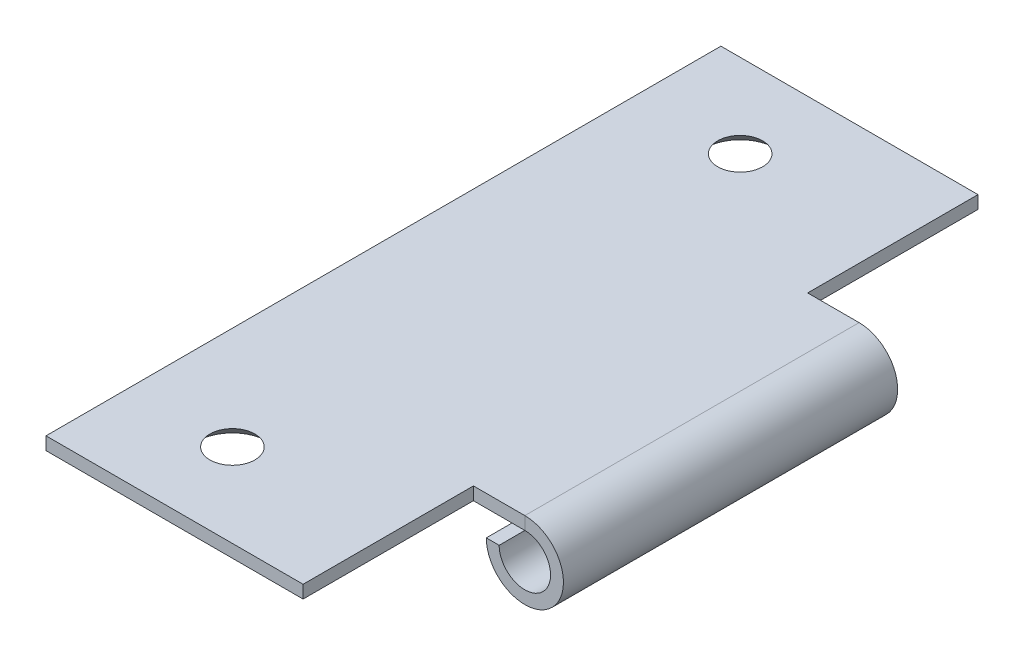
ISO-10303-21;
HEADER;
FILE_DESCRIPTION(('STEP AP214'),'2;1');
FILE_NAME('part.step','',(''),(''),'','','');
FILE_SCHEMA(('AUTOMOTIVE_DESIGN { 1 0 10303 214 1 1 1 1 }'));
ENDSEC;
DATA;
#1=APPLICATION_CONTEXT('core data for automotive mechanical design processes');
#2=APPLICATION_PROTOCOL_DEFINITION('international standard','automotive_design',2000,#1);
#3=PRODUCT_CONTEXT('',#1,'mechanical');
#4=PRODUCT('Part','Part','',(#3));
#5=PRODUCT_RELATED_PRODUCT_CATEGORY('part','',(#4));
#6=PRODUCT_DEFINITION_FORMATION('','',#4);
#7=PRODUCT_DEFINITION_CONTEXT('part definition',#1,'design');
#8=PRODUCT_DEFINITION('design','',#6,#7);
#9=PRODUCT_DEFINITION_SHAPE('','',#8);
#10=(LENGTH_UNIT() NAMED_UNIT(*) SI_UNIT(.MILLI.,.METRE.));
#11=(NAMED_UNIT(*) PLANE_ANGLE_UNIT() SI_UNIT($,.RADIAN.));
#12=(NAMED_UNIT(*) SI_UNIT($,.STERADIAN.) SOLID_ANGLE_UNIT());
#13=UNCERTAINTY_MEASURE_WITH_UNIT(LENGTH_MEASURE(1.E-05),#10,'distance_accuracy_value','');
#14=(GEOMETRIC_REPRESENTATION_CONTEXT(3) GLOBAL_UNCERTAINTY_ASSIGNED_CONTEXT((#13)) GLOBAL_UNIT_ASSIGNED_CONTEXT((#10,
#11,#12)) REPRESENTATION_CONTEXT('',''));
#15=CARTESIAN_POINT('',(0.,0.,0.));
#16=DIRECTION('',(0.,0.,1.));
#17=DIRECTION('',(1.,0.,0.));
#18=AXIS2_PLACEMENT_3D('',#15,#16,#17);
#19=CARTESIAN_POINT('',(-13.2055126779,-1.,-26.4820024566614));
#20=DIRECTION('',(-1.,0.,0.));
#21=DIRECTION('',(0.,0.,1.));
#22=AXIS2_PLACEMENT_3D('',#19,#20,#21);
#23=PLANE('',#22);
#24=DIRECTION('',(0.,0.,1.));
#25=VECTOR('',#24,1.);
#26=CARTESIAN_POINT('',(-13.2055126779,0.,-26.4820024566614));
#27=LINE('',#26,#25);
#28=CARTESIAN_POINT('',(-13.2055126779,0.,-26.4820024566614));
#29=VERTEX_POINT('',#28);
#30=CARTESIAN_POINT('',(-13.2055126779,0.,26.0179975433386));
#31=VERTEX_POINT('',#30);
#32=EDGE_CURVE('E138',#29,#31,#27,.T.);
#33=ORIENTED_EDGE('',*,*,#32,.F.);
#34=DIRECTION('',(0.,1.,0.));
#35=VECTOR('',#34,1.);
#36=CARTESIAN_POINT('',(-13.2055126779,-1.,-26.4820024566614));
#37=LINE('',#36,#35);
#38=CARTESIAN_POINT('',(-13.2055126779,-1.,-26.4820024566614));
#39=VERTEX_POINT('',#38);
#40=EDGE_CURVE('E11',#39,#29,#37,.T.);
#41=ORIENTED_EDGE('',*,*,#40,.F.);
#42=DIRECTION('',(0.,0.,1.));
#43=VECTOR('',#42,1.);
#44=CARTESIAN_POINT('',(-13.2055126779,-1.,-26.4820024566614));
#45=LINE('',#44,#43);
#46=CARTESIAN_POINT('',(-13.2055126779,-1.,26.0179975433386));
#47=VERTEX_POINT('',#46);
#48=EDGE_CURVE('E159',#39,#47,#45,.T.);
#49=ORIENTED_EDGE('',*,*,#48,.T.);
#50=DIRECTION('',(0.,1.,0.));
#51=VECTOR('',#50,1.);
#52=CARTESIAN_POINT('',(-13.2055126779,-1.,26.0179975433386));
#53=LINE('',#52,#51);
#54=EDGE_CURVE('E43',#47,#31,#53,.T.);
#55=ORIENTED_EDGE('',*,*,#54,.T.);
#56=EDGE_LOOP('',(#33,#41,#49,#55));
#57=FACE_BOUND('',#56,.T.);
#58=ADVANCED_FACE('F40',(#57),#23,.T.);
#59=CARTESIAN_POINT('',(6.79448732210002,-1.,-26.4820024566614));
#60=DIRECTION('',(0.,0.,-1.));
#61=DIRECTION('',(-1.,0.,0.));
#62=AXIS2_PLACEMENT_3D('',#59,#60,#61);
#63=PLANE('',#62);
#64=DIRECTION('',(-1.,0.,0.));
#65=VECTOR('',#64,1.);
#66=CARTESIAN_POINT('',(6.79448732210002,0.,-26.4820024566614));
#67=LINE('',#66,#65);
#68=CARTESIAN_POINT('',(6.79448732210002,0.,-26.4820024566614));
#69=VERTEX_POINT('',#68);
#70=EDGE_CURVE('E157',#69,#29,#67,.T.);
#71=ORIENTED_EDGE('',*,*,#70,.F.);
#72=DIRECTION('',(0.,1.,0.));
#73=VECTOR('',#72,1.);
#74=CARTESIAN_POINT('',(6.79448732210002,-1.,-26.4820024566614));
#75=LINE('',#74,#73);
#76=CARTESIAN_POINT('',(6.79448732210002,-1.,-26.4820024566614));
#77=VERTEX_POINT('',#76);
#78=EDGE_CURVE('E49',#77,#69,#75,.T.);
#79=ORIENTED_EDGE('',*,*,#78,.F.);
#80=DIRECTION('',(-1.,0.,0.));
#81=VECTOR('',#80,1.);
#82=CARTESIAN_POINT('',(6.79448732210002,-1.,-26.4820024566614));
#83=LINE('',#82,#81);
#84=EDGE_CURVE('E127',#77,#39,#83,.T.);
#85=ORIENTED_EDGE('',*,*,#84,.T.);
#86=ORIENTED_EDGE('',*,*,#40,.T.);
#87=EDGE_LOOP('',(#71,#79,#85,#86));
#88=FACE_BOUND('',#87,.T.);
#89=ADVANCED_FACE('F171',(#88),#63,.T.);
#90=CARTESIAN_POINT('',(6.79448732210002,-1.,-26.4820024566614));
#91=DIRECTION('',(1.,0.,0.));
#92=DIRECTION('',(0.,0.,-1.));
#93=AXIS2_PLACEMENT_3D('',#90,#91,#92);
#94=PLANE('',#93);
#95=DIRECTION('',(0.,0.,-1.));
#96=VECTOR('',#95,1.);
#97=CARTESIAN_POINT('',(6.79448732210002,0.,-26.4820024566614));
#98=LINE('',#97,#96);
#99=CARTESIAN_POINT('',(6.79448732210003,0.,-13.2320024566614));
#100=VERTEX_POINT('',#99);
#101=EDGE_CURVE('E115',#100,#69,#98,.T.);
#102=ORIENTED_EDGE('',*,*,#101,.F.);
#103=DIRECTION('',(0.,1.,0.));
#104=VECTOR('',#103,1.);
#105=CARTESIAN_POINT('',(6.79448732210003,-1.,-13.2320024566614));
#106=LINE('',#105,#104);
#107=CARTESIAN_POINT('',(6.79448732210003,-1.,-13.2320024566614));
#108=VERTEX_POINT('',#107);
#109=EDGE_CURVE('E110',#108,#100,#106,.T.);
#110=ORIENTED_EDGE('',*,*,#109,.F.);
#111=DIRECTION('',(0.,0.,-1.));
#112=VECTOR('',#111,1.);
#113=CARTESIAN_POINT('',(6.79448732210002,-1.,-26.4820024566614));
#114=LINE('',#113,#112);
#115=EDGE_CURVE('E113',#108,#77,#114,.T.);
#116=ORIENTED_EDGE('',*,*,#115,.T.);
#117=ORIENTED_EDGE('',*,*,#78,.T.);
#118=EDGE_LOOP('',(#102,#110,#116,#117));
#119=FACE_BOUND('',#118,.T.);
#120=ADVANCED_FACE('F112',(#119),#94,.T.);
#121=CARTESIAN_POINT('',(10.7944873221,-1.,-13.2320024566614));
#122=DIRECTION('',(0.,0.,-1.));
#123=DIRECTION('',(-1.,0.,0.));
#124=AXIS2_PLACEMENT_3D('',#121,#122,#123);
#125=PLANE('',#124);
#126=DIRECTION('',(-1.,0.,0.));
#127=VECTOR('',#126,1.);
#128=CARTESIAN_POINT('',(10.7944873221,0.,-13.2320024566614));
#129=LINE('',#128,#127);
#130=CARTESIAN_POINT('',(10.7944873221,0.,-13.2320024566614));
#131=VERTEX_POINT('',#130);
#132=EDGE_CURVE('E154',#131,#100,#129,.T.);
#133=ORIENTED_EDGE('',*,*,#132,.F.);
#134=DIRECTION('',(0.,1.,0.));
#135=VECTOR('',#134,1.);
#136=CARTESIAN_POINT('',(10.7944873221,-1.,-13.2320024566614));
#137=LINE('',#136,#135);
#138=CARTESIAN_POINT('',(10.7944873221,-1.,-13.2320024566614));
#139=VERTEX_POINT('',#138);
#140=EDGE_CURVE('E120',#139,#131,#137,.T.);
#141=ORIENTED_EDGE('',*,*,#140,.F.);
#142=DIRECTION('',(-1.,0.,0.));
#143=VECTOR('',#142,1.);
#144=CARTESIAN_POINT('',(10.7944873221,-1.,-13.2320024566614));
#145=LINE('',#144,#143);
#146=EDGE_CURVE('E125',#139,#108,#145,.T.);
#147=ORIENTED_EDGE('',*,*,#146,.T.);
#148=ORIENTED_EDGE('',*,*,#109,.T.);
#149=EDGE_LOOP('',(#133,#141,#147,#148));
#150=FACE_BOUND('',#149,.T.);
#151=ADVANCED_FACE('F129',(#150),#125,.T.);
#152=CARTESIAN_POINT('',(10.7944873221,-1.,12.7679975433386));
#153=DIRECTION('',(0.,0.,1.));
#154=DIRECTION('',(1.,0.,0.));
#155=AXIS2_PLACEMENT_3D('',#152,#153,#154);
#156=PLANE('',#155);
#157=DIRECTION('',(1.,0.,0.));
#158=VECTOR('',#157,1.);
#159=CARTESIAN_POINT('',(10.7944873221,0.,12.7679975433386));
#160=LINE('',#159,#158);
#161=CARTESIAN_POINT('',(6.79448732210003,0.,12.7679975433386));
#162=VERTEX_POINT('',#161);
#163=CARTESIAN_POINT('',(10.7944873221,0.,12.7679975433386));
#164=VERTEX_POINT('',#163);
#165=EDGE_CURVE('E148',#162,#164,#160,.T.);
#166=ORIENTED_EDGE('',*,*,#165,.F.);
#167=DIRECTION('',(0.,1.,0.));
#168=VECTOR('',#167,1.);
#169=CARTESIAN_POINT('',(6.79448732210003,-1.,12.7679975433386));
#170=LINE('',#169,#168);
#171=CARTESIAN_POINT('',(6.79448732210003,-1.,12.7679975433386));
#172=VERTEX_POINT('',#171);
#173=EDGE_CURVE('E165',#172,#162,#170,.T.);
#174=ORIENTED_EDGE('',*,*,#173,.F.);
#175=DIRECTION('',(1.,0.,0.));
#176=VECTOR('',#175,1.);
#177=CARTESIAN_POINT('',(10.7944873221,-1.,12.7679975433386));
#178=LINE('',#177,#176);
#179=CARTESIAN_POINT('',(10.7944873221,-1.,12.7679975433386));
#180=VERTEX_POINT('',#179);
#181=EDGE_CURVE('E133',#172,#180,#178,.T.);
#182=ORIENTED_EDGE('',*,*,#181,.T.);
#183=DIRECTION('',(0.,1.,0.));
#184=VECTOR('',#183,1.);
#185=CARTESIAN_POINT('',(10.7944873221,-1.,12.7679975433386));
#186=LINE('',#185,#184);
#187=EDGE_CURVE('E163',#180,#164,#186,.T.);
#188=ORIENTED_EDGE('',*,*,#187,.T.);
#189=EDGE_LOOP('',(#166,#174,#182,#188));
#190=FACE_BOUND('',#189,.T.);
#191=ADVANCED_FACE('F184',(#190),#156,.T.);
#192=CARTESIAN_POINT('',(6.79448732210003,-1.,12.7679975433386));
#193=DIRECTION('',(1.,0.,0.));
#194=DIRECTION('',(0.,0.,-1.));
#195=AXIS2_PLACEMENT_3D('',#192,#193,#194);
#196=PLANE('',#195);
#197=DIRECTION('',(0.,0.,-1.));
#198=VECTOR('',#197,1.);
#199=CARTESIAN_POINT('',(6.79448732210003,0.,12.7679975433386));
#200=LINE('',#199,#198);
#201=CARTESIAN_POINT('',(6.79448732210002,0.,26.0179975433386));
#202=VERTEX_POINT('',#201);
#203=EDGE_CURVE('E145',#202,#162,#200,.T.);
#204=ORIENTED_EDGE('',*,*,#203,.F.);
#205=DIRECTION('',(0.,1.,0.));
#206=VECTOR('',#205,1.);
#207=CARTESIAN_POINT('',(6.79448732210002,-1.,26.0179975433386));
#208=LINE('',#207,#206);
#209=CARTESIAN_POINT('',(6.79448732210002,-1.,26.0179975433386));
#210=VERTEX_POINT('',#209);
#211=EDGE_CURVE('E166',#210,#202,#208,.T.);
#212=ORIENTED_EDGE('',*,*,#211,.F.);
#213=DIRECTION('',(0.,0.,-1.));
#214=VECTOR('',#213,1.);
#215=CARTESIAN_POINT('',(6.79448732210003,-1.,12.7679975433386));
#216=LINE('',#215,#214);
#217=EDGE_CURVE('E273',#210,#172,#216,.T.);
#218=ORIENTED_EDGE('',*,*,#217,.T.);
#219=ORIENTED_EDGE('',*,*,#173,.T.);
#220=EDGE_LOOP('',(#204,#212,#218,#219));
#221=FACE_BOUND('',#220,.T.);
#222=ADVANCED_FACE('F187',(#221),#196,.T.);
#223=CARTESIAN_POINT('',(6.79448732210002,-1.,26.0179975433386));
#224=DIRECTION('',(0.,0.,1.));
#225=DIRECTION('',(1.,0.,0.));
#226=AXIS2_PLACEMENT_3D('',#223,#224,#225);
#227=PLANE('',#226);
#228=DIRECTION('',(1.,0.,0.));
#229=VECTOR('',#228,1.);
#230=CARTESIAN_POINT('',(6.79448732210002,0.,26.0179975433386));
#231=LINE('',#230,#229);
#232=EDGE_CURVE('E141',#31,#202,#231,.T.);
#233=ORIENTED_EDGE('',*,*,#232,.F.);
#234=ORIENTED_EDGE('',*,*,#54,.F.);
#235=DIRECTION('',(1.,0.,0.));
#236=VECTOR('',#235,1.);
#237=CARTESIAN_POINT('',(6.79448732210002,-1.,26.0179975433386));
#238=LINE('',#237,#236);
#239=EDGE_CURVE('E271',#47,#210,#238,.T.);
#240=ORIENTED_EDGE('',*,*,#239,.T.);
#241=ORIENTED_EDGE('',*,*,#211,.T.);
#242=EDGE_LOOP('',(#233,#234,#240,#241));
#243=FACE_BOUND('',#242,.T.);
#244=ADVANCED_FACE('F168',(#243),#227,.T.);
#245=CARTESIAN_POINT('',(0.,-1.,0.));
#246=DIRECTION('',(0.,-1.,0.));
#247=DIRECTION('',(0.,0.,-1.));
#248=AXIS2_PLACEMENT_3D('',#245,#246,#247);
#249=PLANE('',#248);
#250=CARTESIAN_POINT('',(-5.20551267789998,-1.,-19.9820024566614));
#251=DIRECTION('',(0.,-1.,0.));
#252=DIRECTION('',(0.,0.,-1.));
#253=AXIS2_PLACEMENT_3D('',#250,#251,#252);
#254=CIRCLE('',#253,2.75);
#255=CARTESIAN_POINT('',(-5.20551267789998,-1.,-22.7320024566614));
#256=VERTEX_POINT('',#255);
#257=EDGE_CURVE('E234',#256,#256,#254,.T.);
#258=ORIENTED_EDGE('',*,*,#257,.F.);
#259=EDGE_LOOP('',(#258));
#260=FACE_BOUND('',#259,.T.);
#261=CARTESIAN_POINT('',(-5.20551267789997,-1.,19.5179975433386));
#262=DIRECTION('',(0.,-1.,0.));
#263=DIRECTION('',(0.,0.,-1.));
#264=AXIS2_PLACEMENT_3D('',#261,#262,#263);
#265=CIRCLE('',#264,2.75);
#266=CARTESIAN_POINT('',(-5.20551267789997,-1.,16.7679975433386));
#267=VERTEX_POINT('',#266);
#268=EDGE_CURVE('E238',#267,#267,#265,.T.);
#269=ORIENTED_EDGE('',*,*,#268,.F.);
#270=EDGE_LOOP('',(#269));
#271=FACE_BOUND('',#270,.T.);
#272=ORIENTED_EDGE('',*,*,#48,.F.);
#273=ORIENTED_EDGE('',*,*,#84,.F.);
#274=ORIENTED_EDGE('',*,*,#115,.F.);
#275=ORIENTED_EDGE('',*,*,#146,.F.);
#276=DIRECTION('',(0.,0.,-1.));
#277=VECTOR('',#276,1.);
#278=CARTESIAN_POINT('',(10.7944873221,-1.,-13.2320024566614));
#279=LINE('',#278,#277);
#280=EDGE_CURVE('E131',#180,#139,#279,.T.);
#281=ORIENTED_EDGE('',*,*,#280,.F.);
#282=ORIENTED_EDGE('',*,*,#181,.F.);
#283=ORIENTED_EDGE('',*,*,#217,.F.);
#284=ORIENTED_EDGE('',*,*,#239,.F.);
#285=EDGE_LOOP('',(#272,#273,#274,#275,#281,#282,#283,#284));
#286=FACE_BOUND('',#285,.T.);
#287=ADVANCED_FACE('F124',(#260,#271,#286),#249,.T.);
#288=CARTESIAN_POINT('',(0.,0.,0.));
#289=DIRECTION('',(0.,-1.,0.));
#290=DIRECTION('',(0.,0.,-1.));
#291=AXIS2_PLACEMENT_3D('',#288,#289,#290);
#292=PLANE('',#291);
#293=CARTESIAN_POINT('',(-5.20551267789998,0.,-19.9820024566614));
#294=DIRECTION('',(0.,-1.,0.));
#295=DIRECTION('',(0.,0.,-1.));
#296=AXIS2_PLACEMENT_3D('',#293,#294,#295);
#297=CIRCLE('',#296,1.75);
#298=CARTESIAN_POINT('',(-5.20551267789998,0.,-21.7320024566614));
#299=VERTEX_POINT('',#298);
#300=EDGE_CURVE('E237',#299,#299,#297,.T.);
#301=ORIENTED_EDGE('',*,*,#300,.T.);
#302=EDGE_LOOP('',(#301));
#303=FACE_BOUND('',#302,.T.);
#304=CARTESIAN_POINT('',(-5.20551267789997,0.,19.5179975433386));
#305=DIRECTION('',(0.,-1.,0.));
#306=DIRECTION('',(0.,0.,-1.));
#307=AXIS2_PLACEMENT_3D('',#304,#305,#306);
#308=CIRCLE('',#307,1.75);
#309=CARTESIAN_POINT('',(-5.20551267789997,0.,17.7679975433386));
#310=VERTEX_POINT('',#309);
#311=EDGE_CURVE('E241',#310,#310,#308,.T.);
#312=ORIENTED_EDGE('',*,*,#311,.T.);
#313=EDGE_LOOP('',(#312));
#314=FACE_BOUND('',#313,.T.);
#315=ORIENTED_EDGE('',*,*,#32,.T.);
#316=ORIENTED_EDGE('',*,*,#232,.T.);
#317=ORIENTED_EDGE('',*,*,#203,.T.);
#318=ORIENTED_EDGE('',*,*,#165,.T.);
#319=DIRECTION('',(0.,0.,-1.));
#320=VECTOR('',#319,1.);
#321=CARTESIAN_POINT('',(10.7944873221,0.,-13.2320024566614));
#322=LINE('',#321,#320);
#323=EDGE_CURVE('E151',#164,#131,#322,.T.);
#324=ORIENTED_EDGE('',*,*,#323,.T.);
#325=ORIENTED_EDGE('',*,*,#132,.T.);
#326=ORIENTED_EDGE('',*,*,#101,.T.);
#327=ORIENTED_EDGE('',*,*,#70,.T.);
#328=EDGE_LOOP('',(#315,#316,#317,#318,#324,#325,#326,#327));
#329=FACE_BOUND('',#328,.T.);
#330=ADVANCED_FACE('F170',(#303,#314,#329),#292,.F.);
#331=CARTESIAN_POINT('',(8.79448732210003,-2.99999999999998,-0.232002456661381));
#332=DIRECTION('',(0.,-1.,0.));
#333=DIRECTION('',(0.,0.,1.));
#334=AXIS2_PLACEMENT_3D('',#331,#332,#333);
#335=PLANE('',#334);
#336=DIRECTION('',(-1.,0.,0.));
#337=VECTOR('',#336,1.);
#338=CARTESIAN_POINT('',(8.79448732210003,-2.99999999999998,12.7679975433386));
#339=LINE('',#338,#337);
#340=CARTESIAN_POINT('',(8.79448732210003,-2.99999999999998,12.7679975433386));
#341=VERTEX_POINT('',#340);
#342=CARTESIAN_POINT('',(7.79448732210003,-2.99999999999997,12.7679975433386));
#343=VERTEX_POINT('',#342);
#344=EDGE_CURVE('E142',#341,#343,#339,.T.);
#345=ORIENTED_EDGE('',*,*,#344,.F.);
#346=DIRECTION('',(0.,0.,1.));
#347=VECTOR('',#346,1.);
#348=CARTESIAN_POINT('',(8.79448732210003,-2.99999999999998,12.7679975433386));
#349=LINE('',#348,#347);
#350=CARTESIAN_POINT('',(8.79448732210003,-2.99999999999998,-13.2320024566614));
#351=VERTEX_POINT('',#350);
#352=EDGE_CURVE('E247',#351,#341,#349,.T.);
#353=ORIENTED_EDGE('',*,*,#352,.F.);
#354=DIRECTION('',(-1.,0.,0.));
#355=VECTOR('',#354,1.);
#356=CARTESIAN_POINT('',(8.79448732210003,-2.99999999999998,-13.2320024566614));
#357=LINE('',#356,#355);
#358=CARTESIAN_POINT('',(7.79448732210003,-2.99999999999997,-13.2320024566614));
#359=VERTEX_POINT('',#358);
#360=EDGE_CURVE('E251',#351,#359,#357,.T.);
#361=ORIENTED_EDGE('',*,*,#360,.T.);
#362=DIRECTION('',(0.,0.,1.));
#363=VECTOR('',#362,1.);
#364=CARTESIAN_POINT('',(7.79448732210003,-2.99999999999997,12.7679975433386));
#365=LINE('',#364,#363);
#366=EDGE_CURVE('E253',#359,#343,#365,.T.);
#367=ORIENTED_EDGE('',*,*,#366,.T.);
#368=EDGE_LOOP('',(#345,#353,#361,#367));
#369=FACE_BOUND('',#368,.T.);
#370=ADVANCED_FACE('F199',(#369),#335,.F.);
#371=CARTESIAN_POINT('',(10.7944873221,-3.,-13.2320024566614));
#372=DIRECTION('',(0.,0.,-1.));
#373=DIRECTION('',(-1.,0.,0.));
#374=AXIS2_PLACEMENT_3D('',#371,#372,#373);
#375=PLANE('',#374);
#376=ORIENTED_EDGE('',*,*,#360,.F.);
#377=CARTESIAN_POINT('',(10.7944873221,-3.,-13.2320024566614));
#378=DIRECTION('',(0.,0.,1.));
#379=DIRECTION('',(1.,0.,0.));
#380=AXIS2_PLACEMENT_3D('',#377,#378,#379);
#381=CIRCLE('',#380,2.);
#382=EDGE_CURVE('E256',#139,#351,#381,.F.);
#383=ORIENTED_EDGE('',*,*,#382,.F.);
#384=ORIENTED_EDGE('',*,*,#140,.T.);
#385=CARTESIAN_POINT('',(10.7944873221,-3.,-13.2320024566614));
#386=DIRECTION('',(0.,0.,1.));
#387=DIRECTION('',(1.,0.,0.));
#388=AXIS2_PLACEMENT_3D('',#385,#386,#387);
#389=CIRCLE('',#388,3.);
#390=EDGE_CURVE('E248',#131,#359,#389,.F.);
#391=ORIENTED_EDGE('',*,*,#390,.T.);
#392=EDGE_LOOP('',(#376,#383,#384,#391));
#393=FACE_BOUND('',#392,.T.);
#394=ADVANCED_FACE('F208',(#393),#375,.T.);
#395=CARTESIAN_POINT('',(10.7944873221,-3.,12.7679975433386));
#396=DIRECTION('',(0.,0.,-1.));
#397=DIRECTION('',(-1.,0.,0.));
#398=AXIS2_PLACEMENT_3D('',#395,#396,#397);
#399=PLANE('',#398);
#400=CARTESIAN_POINT('',(10.7944873221,-3.,12.7679975433386));
#401=DIRECTION('',(0.,0.,1.));
#402=DIRECTION('',(1.,0.,0.));
#403=AXIS2_PLACEMENT_3D('',#400,#401,#402);
#404=CIRCLE('',#403,2.);
#405=EDGE_CURVE('E261',#341,#180,#404,.T.);
#406=ORIENTED_EDGE('',*,*,#405,.F.);
#407=ORIENTED_EDGE('',*,*,#344,.T.);
#408=CARTESIAN_POINT('',(10.7944873221,-3.,12.7679975433386));
#409=DIRECTION('',(0.,0.,1.));
#410=DIRECTION('',(1.,0.,0.));
#411=AXIS2_PLACEMENT_3D('',#408,#409,#410);
#412=CIRCLE('',#411,3.);
#413=EDGE_CURVE('E252',#343,#164,#412,.T.);
#414=ORIENTED_EDGE('',*,*,#413,.T.);
#415=ORIENTED_EDGE('',*,*,#187,.F.);
#416=EDGE_LOOP('',(#406,#407,#414,#415));
#417=FACE_BOUND('',#416,.T.);
#418=ADVANCED_FACE('F204',(#417),#399,.F.);
#419=CARTESIAN_POINT('',(10.7944873221,-3.,12.7679975433386));
#420=DIRECTION('',(0.,0.,1.));
#421=DIRECTION('',(-1.,0.,0.));
#422=AXIS2_PLACEMENT_3D('',#419,#420,#421);
#423=CYLINDRICAL_SURFACE('',#422,3.);
#424=ORIENTED_EDGE('',*,*,#323,.F.);
#425=ORIENTED_EDGE('',*,*,#413,.F.);
#426=ORIENTED_EDGE('',*,*,#366,.F.);
#427=ORIENTED_EDGE('',*,*,#390,.F.);
#428=EDGE_LOOP('',(#424,#425,#426,#427));
#429=FACE_BOUND('',#428,.T.);
#430=ADVANCED_FACE('F207',(#429),#423,.T.);
#431=CARTESIAN_POINT('',(10.7944873221,-3.,12.7679975433386));
#432=DIRECTION('',(0.,0.,1.));
#433=DIRECTION('',(-1.,0.,0.));
#434=AXIS2_PLACEMENT_3D('',#431,#432,#433);
#435=CYLINDRICAL_SURFACE('',#434,2.);
#436=ORIENTED_EDGE('',*,*,#280,.T.);
#437=ORIENTED_EDGE('',*,*,#382,.T.);
#438=ORIENTED_EDGE('',*,*,#352,.T.);
#439=ORIENTED_EDGE('',*,*,#405,.T.);
#440=EDGE_LOOP('',(#436,#437,#438,#439));
#441=FACE_BOUND('',#440,.T.);
#442=ADVANCED_FACE('F216',(#441),#435,.F.);
#443=CARTESIAN_POINT('',(-5.20551267789997,-1.,19.5179975433386));
#444=DIRECTION('',(0.,-1.,0.));
#445=DIRECTION('',(0.,0.,-1.));
#446=AXIS2_PLACEMENT_3D('',#443,#444,#445);
#447=CONICAL_SURFACE('',#446,2.75,0.785398163397448);
#448=ORIENTED_EDGE('',*,*,#268,.T.);
#449=EDGE_LOOP('',(#448));
#450=FACE_BOUND('',#449,.T.);
#451=ORIENTED_EDGE('',*,*,#311,.F.);
#452=EDGE_LOOP('',(#451));
#453=FACE_BOUND('',#452,.T.);
#454=ADVANCED_FACE('F219',(#450,#453),#447,.F.);
#455=CARTESIAN_POINT('',(-5.20551267789998,-1.,-19.9820024566614));
#456=DIRECTION('',(0.,-1.,0.));
#457=DIRECTION('',(0.,0.,-1.));
#458=AXIS2_PLACEMENT_3D('',#455,#456,#457);
#459=CONICAL_SURFACE('',#458,2.75,0.785398163397448);
#460=ORIENTED_EDGE('',*,*,#257,.T.);
#461=EDGE_LOOP('',(#460));
#462=FACE_BOUND('',#461,.T.);
#463=ORIENTED_EDGE('',*,*,#300,.F.);
#464=EDGE_LOOP('',(#463));
#465=FACE_BOUND('',#464,.T.);
#466=ADVANCED_FACE('F226',(#462,#465),#459,.F.);
#467=CLOSED_SHELL('',(#58,#89,#120,#151,#191,#222,#244,#287,#330,#370,#394,#418,#430,#442,#454,#466));
#468=MANIFOLD_SOLID_BREP('B2',#467);
#469=ADVANCED_BREP_SHAPE_REPRESENTATION('',(#18,#468),#14);
#470=SHAPE_DEFINITION_REPRESENTATION(#9,#469);
ENDSEC;
END-ISO-10303-21;
